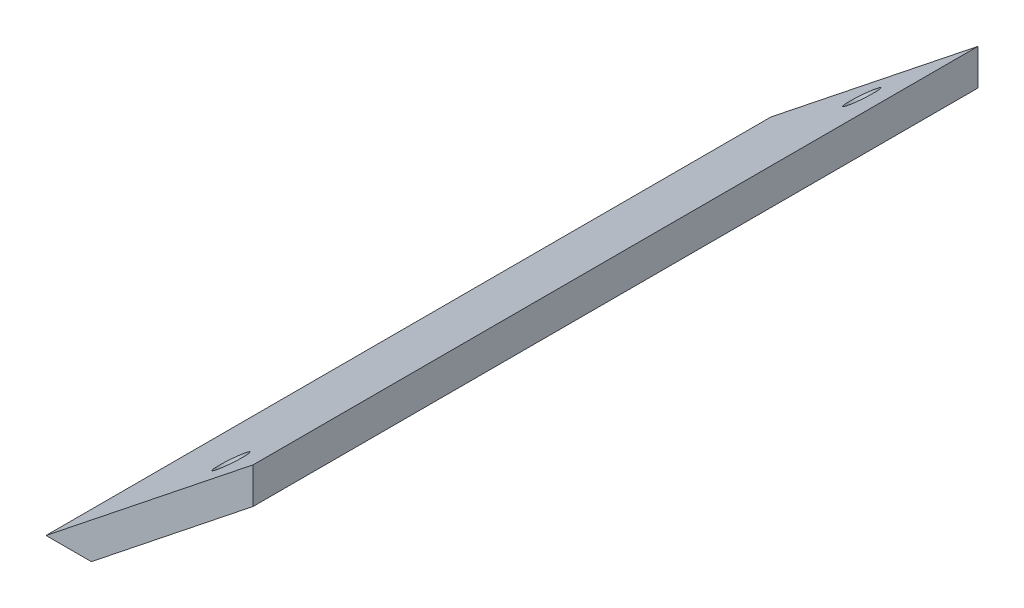
ISO-10303-21;
HEADER;
FILE_DESCRIPTION(('STEP AP214'),'2;1');
FILE_NAME('part.step','',(''),(''),'','','');
FILE_SCHEMA(('AUTOMOTIVE_DESIGN { 1 0 10303 214 1 1 1 1 }'));
ENDSEC;
DATA;
#1=APPLICATION_CONTEXT('core data for automotive mechanical design processes');
#2=APPLICATION_PROTOCOL_DEFINITION('international standard','automotive_design',2000,#1);
#3=PRODUCT_CONTEXT('',#1,'mechanical');
#4=PRODUCT('Part','Part','',(#3));
#5=PRODUCT_RELATED_PRODUCT_CATEGORY('part','',(#4));
#6=PRODUCT_DEFINITION_FORMATION('','',#4);
#7=PRODUCT_DEFINITION_CONTEXT('part definition',#1,'design');
#8=PRODUCT_DEFINITION('design','',#6,#7);
#9=PRODUCT_DEFINITION_SHAPE('','',#8);
#10=(LENGTH_UNIT() NAMED_UNIT(*) SI_UNIT(.MILLI.,.METRE.));
#11=(NAMED_UNIT(*) PLANE_ANGLE_UNIT() SI_UNIT($,.RADIAN.));
#12=(NAMED_UNIT(*) SI_UNIT($,.STERADIAN.) SOLID_ANGLE_UNIT());
#13=UNCERTAINTY_MEASURE_WITH_UNIT(LENGTH_MEASURE(1.E-05),#10,'distance_accuracy_value','');
#14=(GEOMETRIC_REPRESENTATION_CONTEXT(3) GLOBAL_UNCERTAINTY_ASSIGNED_CONTEXT((#13)) GLOBAL_UNIT_ASSIGNED_CONTEXT((#10,
#11,#12)) REPRESENTATION_CONTEXT('',''));
#15=CARTESIAN_POINT('',(0.,0.,0.));
#16=DIRECTION('',(0.,0.,1.));
#17=DIRECTION('',(1.,0.,0.));
#18=AXIS2_PLACEMENT_3D('',#15,#16,#17);
#19=CARTESIAN_POINT('',(0.,17.5,77.));
#20=DIRECTION('',(0.622523565821539,-0.782601054175649,0.));
#21=DIRECTION('',(0.782601054175649,0.622523565821539,0.));
#22=AXIS2_PLACEMENT_3D('',#19,#20,#21);
#23=PLANE('',#22);
#24=CARTESIAN_POINT('',(-7.34577807669416,11.6567674389933,72.));
#25=DIRECTION('',(-0.622523565821539,0.782601054175649,0.));
#26=DIRECTION('',(-0.782601054175649,-0.622523565821539,0.));
#27=AXIS2_PLACEMENT_3D('',#24,#25,#26);
#28=CIRCLE('',#27,1.6);
#29=CARTESIAN_POINT('',(-8.5979397633752,10.6607297336788,72.));
#30=VERTEX_POINT('',#29);
#31=EDGE_CURVE('E115',#30,#30,#28,.T.);
#32=ORIENTED_EDGE('',*,*,#31,.F.);
#33=EDGE_LOOP('',(#32));
#34=FACE_BOUND('',#33,.T.);
#35=CARTESIAN_POINT('',(-7.34577807669417,11.6567674389933,5.));
#36=DIRECTION('',(-0.622523565821539,0.782601054175649,0.));
#37=DIRECTION('',(-0.782601054175649,-0.622523565821539,0.));
#38=AXIS2_PLACEMENT_3D('',#35,#36,#37);
#39=CIRCLE('',#38,1.6);
#40=CARTESIAN_POINT('',(-8.59793976337521,10.6607297336788,5.));
#41=VERTEX_POINT('',#40);
#42=EDGE_CURVE('E109',#41,#41,#39,.T.);
#43=ORIENTED_EDGE('',*,*,#42,.F.);
#44=EDGE_LOOP('',(#43));
#45=FACE_BOUND('',#44,.T.);
#46=DIRECTION('',(-0.782601054175649,-0.622523565821539,0.));
#47=VECTOR('',#46,1.);
#48=CARTESIAN_POINT('',(0.,17.5,0.));
#49=LINE('',#48,#47);
#50=CARTESIAN_POINT('',(0.,17.5,0.));
#51=VERTEX_POINT('',#50);
#52=CARTESIAN_POINT('',(-22.,0.,0.));
#53=VERTEX_POINT('',#52);
#54=EDGE_CURVE('E93',#51,#53,#49,.T.);
#55=ORIENTED_EDGE('',*,*,#54,.T.);
#56=DIRECTION('',(0.,0.,-1.));
#57=VECTOR('',#56,1.);
#58=CARTESIAN_POINT('',(-22.,0.,77.));
#59=LINE('',#58,#57);
#60=CARTESIAN_POINT('',(-22.,0.,77.));
#61=VERTEX_POINT('',#60);
#62=EDGE_CURVE('E11',#61,#53,#59,.T.);
#63=ORIENTED_EDGE('',*,*,#62,.F.);
#64=DIRECTION('',(-0.782601054175649,-0.622523565821539,0.));
#65=VECTOR('',#64,1.);
#66=CARTESIAN_POINT('',(0.,17.5,77.));
#67=LINE('',#66,#65);
#68=CARTESIAN_POINT('',(0.,17.5,77.));
#69=VERTEX_POINT('',#68);
#70=EDGE_CURVE('E81',#69,#61,#67,.T.);
#71=ORIENTED_EDGE('',*,*,#70,.F.);
#72=DIRECTION('',(0.,0.,-1.));
#73=VECTOR('',#72,1.);
#74=CARTESIAN_POINT('',(0.,17.5,77.));
#75=LINE('',#74,#73);
#76=EDGE_CURVE('E89',#69,#51,#75,.T.);
#77=ORIENTED_EDGE('',*,*,#76,.T.);
#78=EDGE_LOOP('',(#55,#63,#71,#77));
#79=FACE_BOUND('',#78,.T.);
#80=ADVANCED_FACE('F30',(#34,#45,#79),#23,.F.);
#81=CARTESIAN_POINT('',(-22.,0.,77.));
#82=DIRECTION('',(0.,1.,0.));
#83=DIRECTION('',(0.,0.,1.));
#84=AXIS2_PLACEMENT_3D('',#81,#82,#83);
#85=PLANE('',#84);
#86=DIRECTION('',(1.,0.,0.));
#87=VECTOR('',#86,1.);
#88=CARTESIAN_POINT('',(-22.,0.,0.));
#89=LINE('',#88,#87);
#90=CARTESIAN_POINT('',(-17.1809053267872,0.,0.));
#91=VERTEX_POINT('',#90);
#92=EDGE_CURVE('E85',#53,#91,#89,.T.);
#93=ORIENTED_EDGE('',*,*,#92,.T.);
#94=DIRECTION('',(0.,0.,-1.));
#95=VECTOR('',#94,1.);
#96=CARTESIAN_POINT('',(-17.1809053267872,0.,77.));
#97=LINE('',#96,#95);
#98=CARTESIAN_POINT('',(-17.1809053267872,0.,77.));
#99=VERTEX_POINT('',#98);
#100=EDGE_CURVE('E38',#99,#91,#97,.T.);
#101=ORIENTED_EDGE('',*,*,#100,.F.);
#102=DIRECTION('',(1.,0.,0.));
#103=VECTOR('',#102,1.);
#104=CARTESIAN_POINT('',(-22.,0.,77.));
#105=LINE('',#104,#103);
#106=EDGE_CURVE('E76',#61,#99,#105,.T.);
#107=ORIENTED_EDGE('',*,*,#106,.F.);
#108=ORIENTED_EDGE('',*,*,#62,.T.);
#109=EDGE_LOOP('',(#93,#101,#107,#108));
#110=FACE_BOUND('',#109,.T.);
#111=ADVANCED_FACE('F84',(#110),#85,.F.);
#112=CARTESIAN_POINT('',(-17.1809053267872,0.,77.));
#113=DIRECTION('',(-0.622523565821539,0.782601054175648,0.));
#114=DIRECTION('',(-0.782601054175648,-0.622523565821539,0.));
#115=AXIS2_PLACEMENT_3D('',#112,#113,#114);
#116=PLANE('',#115);
#117=CARTESIAN_POINT('',(-5.47820737922954,9.30896427646634,72.));
#118=DIRECTION('',(-0.622523565821539,0.782601054175648,0.));
#119=DIRECTION('',(-0.782601054175648,-0.622523565821539,0.));
#120=AXIS2_PLACEMENT_3D('',#117,#118,#119);
#121=CIRCLE('',#120,1.6);
#122=CARTESIAN_POINT('',(-6.73036906591058,8.31292657115188,72.));
#123=VERTEX_POINT('',#122);
#124=EDGE_CURVE('E112',#123,#123,#121,.F.);
#125=ORIENTED_EDGE('',*,*,#124,.F.);
#126=EDGE_LOOP('',(#125));
#127=FACE_BOUND('',#126,.T.);
#128=CARTESIAN_POINT('',(-5.47820737922955,9.30896427646634,5.));
#129=DIRECTION('',(-0.622523565821539,0.782601054175648,0.));
#130=DIRECTION('',(-0.782601054175648,-0.622523565821539,0.));
#131=AXIS2_PLACEMENT_3D('',#128,#129,#130);
#132=CIRCLE('',#131,1.6);
#133=CARTESIAN_POINT('',(-6.73036906591059,8.31292657115187,5.));
#134=VERTEX_POINT('',#133);
#135=EDGE_CURVE('E96',#134,#134,#132,.F.);
#136=ORIENTED_EDGE('',*,*,#135,.F.);
#137=EDGE_LOOP('',(#136));
#138=FACE_BOUND('',#137,.T.);
#139=DIRECTION('',(0.782601054175648,0.622523565821539,0.));
#140=VECTOR('',#139,1.);
#141=CARTESIAN_POINT('',(-17.1809053267872,0.,0.));
#142=LINE('',#141,#140);
#143=CARTESIAN_POINT('',(0.,13.6666292372171,0.));
#144=VERTEX_POINT('',#143);
#145=EDGE_CURVE('E63',#91,#144,#142,.T.);
#146=ORIENTED_EDGE('',*,*,#145,.T.);
#147=DIRECTION('',(0.,0.,-1.));
#148=VECTOR('',#147,1.);
#149=CARTESIAN_POINT('',(0.,13.6666292372171,77.));
#150=LINE('',#149,#148);
#151=CARTESIAN_POINT('',(0.,13.6666292372171,77.));
#152=VERTEX_POINT('',#151);
#153=EDGE_CURVE('E86',#152,#144,#150,.T.);
#154=ORIENTED_EDGE('',*,*,#153,.F.);
#155=DIRECTION('',(0.782601054175648,0.622523565821539,0.));
#156=VECTOR('',#155,1.);
#157=CARTESIAN_POINT('',(-17.1809053267872,0.,77.));
#158=LINE('',#157,#156);
#159=EDGE_CURVE('E79',#99,#152,#158,.T.);
#160=ORIENTED_EDGE('',*,*,#159,.F.);
#161=ORIENTED_EDGE('',*,*,#100,.T.);
#162=EDGE_LOOP('',(#146,#154,#160,#161));
#163=FACE_BOUND('',#162,.T.);
#164=ADVANCED_FACE('F87',(#127,#138,#163),#116,.F.);
#165=CARTESIAN_POINT('',(0.,13.6666292372171,77.));
#166=DIRECTION('',(-1.,0.,0.));
#167=DIRECTION('',(0.,-1.,0.));
#168=AXIS2_PLACEMENT_3D('',#165,#166,#167);
#169=PLANE('',#168);
#170=DIRECTION('',(0.,1.,0.));
#171=VECTOR('',#170,1.);
#172=CARTESIAN_POINT('',(0.,13.6666292372171,0.));
#173=LINE('',#172,#171);
#174=EDGE_CURVE('E69',#144,#51,#173,.T.);
#175=ORIENTED_EDGE('',*,*,#174,.T.);
#176=ORIENTED_EDGE('',*,*,#76,.F.);
#177=DIRECTION('',(0.,1.,0.));
#178=VECTOR('',#177,1.);
#179=CARTESIAN_POINT('',(0.,13.6666292372171,77.));
#180=LINE('',#179,#178);
#181=EDGE_CURVE('E46',#152,#69,#180,.T.);
#182=ORIENTED_EDGE('',*,*,#181,.F.);
#183=ORIENTED_EDGE('',*,*,#153,.T.);
#184=EDGE_LOOP('',(#175,#176,#182,#183));
#185=FACE_BOUND('',#184,.T.);
#186=ADVANCED_FACE('F101',(#185),#169,.F.);
#187=CARTESIAN_POINT('',(0.,17.5,77.));
#188=DIRECTION('',(0.,0.,-1.));
#189=DIRECTION('',(-1.,0.,0.));
#190=AXIS2_PLACEMENT_3D('',#187,#188,#189);
#191=PLANE('',#190);
#192=ORIENTED_EDGE('',*,*,#70,.T.);
#193=ORIENTED_EDGE('',*,*,#106,.T.);
#194=ORIENTED_EDGE('',*,*,#159,.T.);
#195=ORIENTED_EDGE('',*,*,#181,.T.);
#196=EDGE_LOOP('',(#192,#193,#194,#195));
#197=FACE_BOUND('',#196,.T.);
#198=ADVANCED_FACE('F77',(#197),#191,.F.);
#199=CARTESIAN_POINT('',(0.,17.5,0.));
#200=DIRECTION('',(0.,0.,-1.));
#201=DIRECTION('',(-1.,0.,0.));
#202=AXIS2_PLACEMENT_3D('',#199,#200,#201);
#203=PLANE('',#202);
#204=ORIENTED_EDGE('',*,*,#54,.F.);
#205=ORIENTED_EDGE('',*,*,#174,.F.);
#206=ORIENTED_EDGE('',*,*,#145,.F.);
#207=ORIENTED_EDGE('',*,*,#92,.F.);
#208=EDGE_LOOP('',(#204,#205,#206,#207));
#209=FACE_BOUND('',#208,.T.);
#210=ADVANCED_FACE('F104',(#209),#203,.T.);
#211=CARTESIAN_POINT('',(1.1808796265643,0.937540612039782,5.));
#212=DIRECTION('',(-0.622523565821539,0.782601054175649,0.));
#213=DIRECTION('',(-0.782601054175649,-0.622523565821539,0.));
#214=AXIS2_PLACEMENT_3D('',#211,#212,#213);
#215=CYLINDRICAL_SURFACE('',#214,1.6);
#216=ORIENTED_EDGE('',*,*,#42,.T.);
#217=EDGE_LOOP('',(#216));
#218=FACE_BOUND('',#217,.T.);
#219=ORIENTED_EDGE('',*,*,#135,.T.);
#220=EDGE_LOOP('',(#219));
#221=FACE_BOUND('',#220,.T.);
#222=ADVANCED_FACE('F126',(#218,#221),#215,.F.);
#223=CARTESIAN_POINT('',(1.18087962656431,0.937540612039788,72.));
#224=DIRECTION('',(-0.622523565821539,0.782601054175649,0.));
#225=DIRECTION('',(-0.782601054175649,-0.622523565821539,0.));
#226=AXIS2_PLACEMENT_3D('',#223,#224,#225);
#227=CYLINDRICAL_SURFACE('',#226,1.6);
#228=ORIENTED_EDGE('',*,*,#31,.T.);
#229=EDGE_LOOP('',(#228));
#230=FACE_BOUND('',#229,.T.);
#231=ORIENTED_EDGE('',*,*,#124,.T.);
#232=EDGE_LOOP('',(#231));
#233=FACE_BOUND('',#232,.T.);
#234=ADVANCED_FACE('F119',(#230,#233),#227,.F.);
#235=CLOSED_SHELL('',(#80,#111,#164,#186,#198,#210,#222,#234));
#236=MANIFOLD_SOLID_BREP('B2',#235);
#237=ADVANCED_BREP_SHAPE_REPRESENTATION('',(#18,#236),#14);
#238=SHAPE_DEFINITION_REPRESENTATION(#9,#237);
ENDSEC;
END-ISO-10303-21;
